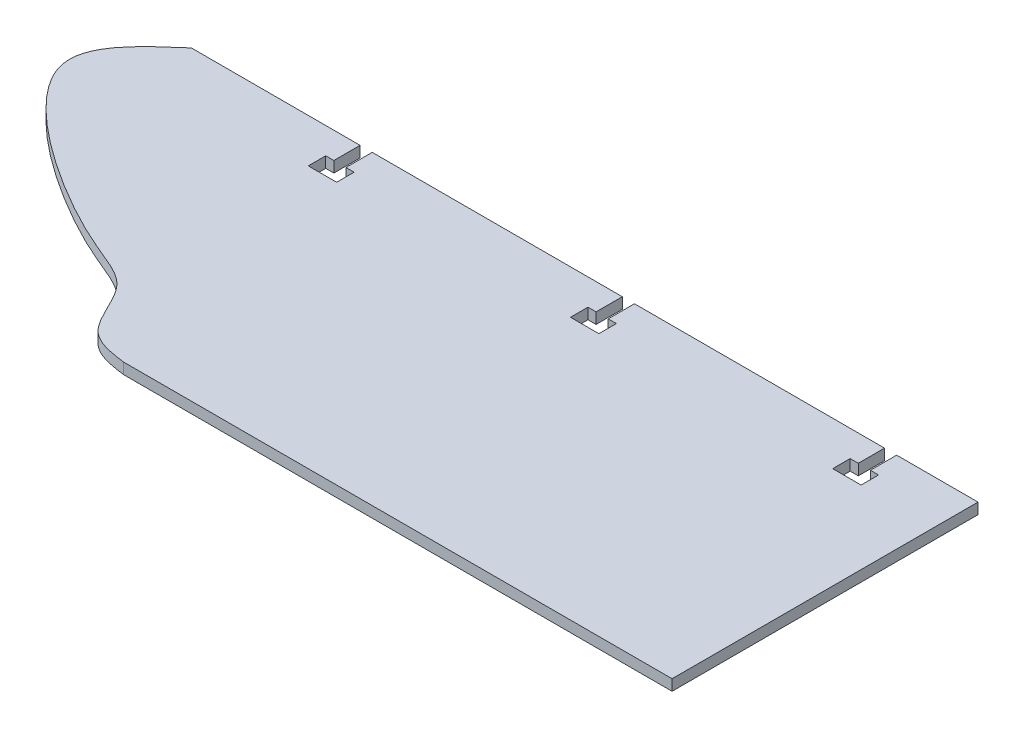
ISO-10303-21;
HEADER;
FILE_DESCRIPTION(('STEP AP214'),'2;1');
FILE_NAME('part.step','',(''),(''),'','','');
FILE_SCHEMA(('AUTOMOTIVE_DESIGN { 1 0 10303 214 1 1 1 1 }'));
ENDSEC;
DATA;
#1=APPLICATION_CONTEXT('core data for automotive mechanical design processes');
#2=APPLICATION_PROTOCOL_DEFINITION('international standard','automotive_design',2000,#1);
#3=PRODUCT_CONTEXT('',#1,'mechanical');
#4=PRODUCT('Part','Part','',(#3));
#5=PRODUCT_RELATED_PRODUCT_CATEGORY('part','',(#4));
#6=PRODUCT_DEFINITION_FORMATION('','',#4);
#7=PRODUCT_DEFINITION_CONTEXT('part definition',#1,'design');
#8=PRODUCT_DEFINITION('design','',#6,#7);
#9=PRODUCT_DEFINITION_SHAPE('','',#8);
#10=(LENGTH_UNIT() NAMED_UNIT(*) SI_UNIT(.MILLI.,.METRE.));
#11=(NAMED_UNIT(*) PLANE_ANGLE_UNIT() SI_UNIT($,.RADIAN.));
#12=(NAMED_UNIT(*) SI_UNIT($,.STERADIAN.) SOLID_ANGLE_UNIT());
#13=UNCERTAINTY_MEASURE_WITH_UNIT(LENGTH_MEASURE(1.E-05),#10,'distance_accuracy_value','');
#14=(GEOMETRIC_REPRESENTATION_CONTEXT(3) GLOBAL_UNCERTAINTY_ASSIGNED_CONTEXT((#13)) GLOBAL_UNIT_ASSIGNED_CONTEXT((#10,
#11,#12)) REPRESENTATION_CONTEXT('',''));
#15=CARTESIAN_POINT('',(0.,0.,0.));
#16=DIRECTION('',(0.,0.,1.));
#17=DIRECTION('',(1.,0.,0.));
#18=AXIS2_PLACEMENT_3D('',#15,#16,#17);
#19=CARTESIAN_POINT('',(-7.32692720957384,-3.175,44.45));
#20=DIRECTION('',(0.,0.,1.));
#21=DIRECTION('',(1.,0.,0.));
#22=AXIS2_PLACEMENT_3D('',#19,#20,#21);
#23=PLANE('',#22);
#24=DIRECTION('',(1.,0.,0.));
#25=VECTOR('',#24,1.);
#26=CARTESIAN_POINT('',(-7.32692720957384,0.,44.45));
#27=LINE('',#26,#25);
#28=CARTESIAN_POINT('',(-45.081302523613,0.,44.45));
#29=VERTEX_POINT('',#28);
#30=CARTESIAN_POINT('',(114.3,0.,44.45));
#31=VERTEX_POINT('',#30);
#32=EDGE_CURVE('E302',#29,#31,#27,.T.);
#33=ORIENTED_EDGE('',*,*,#32,.F.);
#34=DIRECTION('',(0.,1.,0.));
#35=VECTOR('',#34,1.);
#36=CARTESIAN_POINT('',(-45.081302523613,-3.175,44.45));
#37=LINE('',#36,#35);
#38=CARTESIAN_POINT('',(-45.081302523613,-3.175,44.45));
#39=VERTEX_POINT('',#38);
#40=EDGE_CURVE('E10',#39,#29,#37,.T.);
#41=ORIENTED_EDGE('',*,*,#40,.F.);
#42=DIRECTION('',(1.,0.,0.));
#43=VECTOR('',#42,1.);
#44=CARTESIAN_POINT('',(-7.32692720957384,-3.175,44.45));
#45=LINE('',#44,#43);
#46=CARTESIAN_POINT('',(114.3,-3.175,44.45));
#47=VERTEX_POINT('',#46);
#48=EDGE_CURVE('E407',#39,#47,#45,.T.);
#49=ORIENTED_EDGE('',*,*,#48,.T.);
#50=DIRECTION('',(0.,1.,0.));
#51=VECTOR('',#50,1.);
#52=CARTESIAN_POINT('',(114.3,-3.175,44.45));
#53=LINE('',#52,#51);
#54=EDGE_CURVE('E38',#47,#31,#53,.T.);
#55=ORIENTED_EDGE('',*,*,#54,.T.);
#56=EDGE_LOOP('',(#33,#41,#49,#55));
#57=FACE_BOUND('',#56,.T.);
#58=ADVANCED_FACE('F16',(#57),#23,.T.);
#59=CARTESIAN_POINT('',(-114.3,-3.175,-44.45));
#60=CARTESIAN_POINT('',(-122.712622949741,-3.175,-37.1517484903736));
#61=CARTESIAN_POINT('',(-143.440207505629,-3.175,-19.16982701598));
#62=CARTESIAN_POINT('',(-82.8423175853198,-3.175,19.7004032273927));
#63=CARTESIAN_POINT('',(-63.646041049503,-3.175,23.2620201117426));
#64=CARTESIAN_POINT('',(-58.5291170106001,-3.175,42.6152864501039));
#65=CARTESIAN_POINT('',(-49.3668762390292,-3.175,43.865310184985));
#66=CARTESIAN_POINT('',(-45.081302523613,-3.175,44.45));
#67=B_SPLINE_CURVE_WITH_KNOTS('',3,(#59,#60,#61,#62,#63,#64,#65,#66),.UNSPECIFIED.,.F.,.F.,(4,1,
1,1,1,4),(0.,0.210723036526769,0.519193548026157,0.700398339055915,0.859863429127406,1.),.UNSPECIFIED.);
#68=DIRECTION('',(0.,1.,0.));
#69=VECTOR('',#68,1.);
#70=SURFACE_OF_LINEAR_EXTRUSION('',#67,#69);
#71=CARTESIAN_POINT('',(-114.3,0.,-44.45));
#72=CARTESIAN_POINT('',(-122.712622949741,0.,-37.1517484903736));
#73=CARTESIAN_POINT('',(-143.440207505629,0.,-19.16982701598));
#74=CARTESIAN_POINT('',(-82.8423175853198,0.,19.7004032273927));
#75=CARTESIAN_POINT('',(-63.646041049503,0.,23.2620201117426));
#76=CARTESIAN_POINT('',(-58.5291170106001,0.,42.6152864501039));
#77=CARTESIAN_POINT('',(-49.3668762390292,0.,43.865310184985));
#78=CARTESIAN_POINT('',(-45.081302523613,0.,44.45));
#79=B_SPLINE_CURVE_WITH_KNOTS('',3,(#71,#72,#73,#74,#75,#76,#77,#78),.UNSPECIFIED.,.F.,.F.,(4,1,
1,1,1,4),(0.,0.210723036526769,0.519193548026157,0.700398339055915,0.859863429127406,1.),.UNSPECIFIED.);
#80=CARTESIAN_POINT('',(-114.3,0.,-44.45));
#81=VERTEX_POINT('',#80);
#82=EDGE_CURVE('E305',#81,#29,#79,.T.);
#83=ORIENTED_EDGE('',*,*,#82,.F.);
#84=DIRECTION('',(0.,1.,0.));
#85=VECTOR('',#84,1.);
#86=CARTESIAN_POINT('',(-114.3,-3.175,-44.45));
#87=LINE('',#86,#85);
#88=CARTESIAN_POINT('',(-114.3,-3.175,-44.45));
#89=VERTEX_POINT('',#88);
#90=EDGE_CURVE('E25',#89,#81,#87,.T.);
#91=ORIENTED_EDGE('',*,*,#90,.F.);
#92=EDGE_CURVE('E501',#89,#39,#67,.T.);
#93=ORIENTED_EDGE('',*,*,#92,.T.);
#94=ORIENTED_EDGE('',*,*,#40,.T.);
#95=EDGE_LOOP('',(#83,#91,#93,#94));
#96=FACE_BOUND('',#95,.T.);
#97=ADVANCED_FACE('F500',(#96),#70,.T.);
#98=CARTESIAN_POINT('',(-7.32692720957383,-3.175,-44.45));
#99=DIRECTION('',(0.,0.,1.));
#100=DIRECTION('',(1.,0.,0.));
#101=AXIS2_PLACEMENT_3D('',#98,#99,#100);
#102=PLANE('',#101);
#103=DIRECTION('',(1.,0.,0.));
#104=VECTOR('',#103,1.);
#105=CARTESIAN_POINT('',(-7.32692720957383,0.,-44.45));
#106=LINE('',#105,#104);
#107=CARTESIAN_POINT('',(-65.2653,0.,-44.45));
#108=VERTEX_POINT('',#107);
#109=EDGE_CURVE('E311',#81,#108,#106,.T.);
#110=ORIENTED_EDGE('',*,*,#109,.T.);
#111=DIRECTION('',(0.,1.,0.));
#112=VECTOR('',#111,1.);
#113=CARTESIAN_POINT('',(-65.2653,-3.175,-44.45));
#114=LINE('',#113,#112);
#115=CARTESIAN_POINT('',(-65.2653,-3.175,-44.45));
#116=VERTEX_POINT('',#115);
#117=EDGE_CURVE('E482',#116,#108,#114,.T.);
#118=ORIENTED_EDGE('',*,*,#117,.F.);
#119=DIRECTION('',(1.,0.,0.));
#120=VECTOR('',#119,1.);
#121=CARTESIAN_POINT('',(-7.32692720957383,-3.175,-44.45));
#122=LINE('',#121,#120);
#123=EDGE_CURVE('E492',#89,#116,#122,.T.);
#124=ORIENTED_EDGE('',*,*,#123,.F.);
#125=ORIENTED_EDGE('',*,*,#90,.T.);
#126=EDGE_LOOP('',(#110,#118,#124,#125));
#127=FACE_BOUND('',#126,.T.);
#128=ADVANCED_FACE('F490',(#127),#102,.F.);
#129=CARTESIAN_POINT('',(-65.2653,-3.175,-35.3892250344158));
#130=DIRECTION('',(-1.,0.,0.));
#131=DIRECTION('',(0.,0.,1.));
#132=AXIS2_PLACEMENT_3D('',#129,#130,#131);
#133=PLANE('',#132);
#134=DIRECTION('',(0.,0.,1.));
#135=VECTOR('',#134,1.);
#136=CARTESIAN_POINT('',(-65.2653,0.,-35.3892250344158));
#137=LINE('',#136,#135);
#138=CARTESIAN_POINT('',(-65.2653,0.,-36.83));
#139=VERTEX_POINT('',#138);
#140=EDGE_CURVE('E317',#108,#139,#137,.T.);
#141=ORIENTED_EDGE('',*,*,#140,.T.);
#142=DIRECTION('',(0.,1.,0.));
#143=VECTOR('',#142,1.);
#144=CARTESIAN_POINT('',(-65.2653,-3.175,-36.83));
#145=LINE('',#144,#143);
#146=CARTESIAN_POINT('',(-65.2653,-3.175,-36.83));
#147=VERTEX_POINT('',#146);
#148=EDGE_CURVE('E479',#147,#139,#145,.T.);
#149=ORIENTED_EDGE('',*,*,#148,.F.);
#150=DIRECTION('',(0.,0.,1.));
#151=VECTOR('',#150,1.);
#152=CARTESIAN_POINT('',(-65.2653,-3.175,-35.3892250344158));
#153=LINE('',#152,#151);
#154=EDGE_CURVE('E535',#116,#147,#153,.T.);
#155=ORIENTED_EDGE('',*,*,#154,.F.);
#156=ORIENTED_EDGE('',*,*,#117,.T.);
#157=EDGE_LOOP('',(#141,#149,#155,#156));
#158=FACE_BOUND('',#157,.T.);
#159=ADVANCED_FACE('F520',(#158),#133,.F.);
#160=CARTESIAN_POINT('',(-62.5459980219603,-3.175,-36.83));
#161=DIRECTION('',(0.,0.,1.));
#162=DIRECTION('',(1.,0.,0.));
#163=AXIS2_PLACEMENT_3D('',#160,#161,#162);
#164=PLANE('',#163);
#165=DIRECTION('',(1.,0.,0.));
#166=VECTOR('',#165,1.);
#167=CARTESIAN_POINT('',(-62.5459980219603,0.,-36.83));
#168=LINE('',#167,#166);
#169=CARTESIAN_POINT('',(-67.6275,0.,-36.83));
#170=VERTEX_POINT('',#169);
#171=EDGE_CURVE('E321',#170,#139,#168,.T.);
#172=ORIENTED_EDGE('',*,*,#171,.F.);
#173=DIRECTION('',(0.,1.,0.));
#174=VECTOR('',#173,1.);
#175=CARTESIAN_POINT('',(-67.6275,-3.175,-36.83));
#176=LINE('',#175,#174);
#177=CARTESIAN_POINT('',(-67.6275,-3.175,-36.83));
#178=VERTEX_POINT('',#177);
#179=EDGE_CURVE('E476',#178,#170,#176,.T.);
#180=ORIENTED_EDGE('',*,*,#179,.F.);
#181=DIRECTION('',(1.,0.,0.));
#182=VECTOR('',#181,1.);
#183=CARTESIAN_POINT('',(-62.5459980219603,-3.175,-36.83));
#184=LINE('',#183,#182);
#185=EDGE_CURVE('E538',#178,#147,#184,.T.);
#186=ORIENTED_EDGE('',*,*,#185,.T.);
#187=ORIENTED_EDGE('',*,*,#148,.T.);
#188=EDGE_LOOP('',(#172,#180,#186,#187));
#189=FACE_BOUND('',#188,.T.);
#190=ADVANCED_FACE('F695',(#189),#164,.T.);
#191=CARTESIAN_POINT('',(-67.6275,-3.175,-35.2268011206389));
#192=DIRECTION('',(-1.,0.,0.));
#193=DIRECTION('',(0.,0.,1.));
#194=AXIS2_PLACEMENT_3D('',#191,#192,#193);
#195=PLANE('',#194);
#196=DIRECTION('',(0.,0.,1.));
#197=VECTOR('',#196,1.);
#198=CARTESIAN_POINT('',(-67.6275,0.,-35.2268011206389));
#199=LINE('',#198,#197);
#200=CARTESIAN_POINT('',(-67.6275,0.,-31.75));
#201=VERTEX_POINT('',#200);
#202=EDGE_CURVE('E325',#170,#201,#199,.T.);
#203=ORIENTED_EDGE('',*,*,#202,.T.);
#204=DIRECTION('',(0.,1.,0.));
#205=VECTOR('',#204,1.);
#206=CARTESIAN_POINT('',(-67.6275,-3.175,-31.75));
#207=LINE('',#206,#205);
#208=CARTESIAN_POINT('',(-67.6275,-3.175,-31.75));
#209=VERTEX_POINT('',#208);
#210=EDGE_CURVE('E472',#209,#201,#207,.T.);
#211=ORIENTED_EDGE('',*,*,#210,.F.);
#212=DIRECTION('',(0.,0.,1.));
#213=VECTOR('',#212,1.);
#214=CARTESIAN_POINT('',(-67.6275,-3.175,-35.2268011206389));
#215=LINE('',#214,#213);
#216=EDGE_CURVE('E542',#178,#209,#215,.T.);
#217=ORIENTED_EDGE('',*,*,#216,.F.);
#218=ORIENTED_EDGE('',*,*,#179,.T.);
#219=EDGE_LOOP('',(#203,#211,#217,#218));
#220=FACE_BOUND('',#219,.T.);
#221=ADVANCED_FACE('F691',(#220),#195,.F.);
#222=CARTESIAN_POINT('',(-62.5459980219603,-3.175,-31.75));
#223=DIRECTION('',(0.,0.,1.));
#224=DIRECTION('',(1.,0.,0.));
#225=AXIS2_PLACEMENT_3D('',#222,#223,#224);
#226=PLANE('',#225);
#227=DIRECTION('',(1.,0.,0.));
#228=VECTOR('',#227,1.);
#229=CARTESIAN_POINT('',(-62.5459980219603,0.,-31.75));
#230=LINE('',#229,#228);
#231=CARTESIAN_POINT('',(-59.3725,0.,-31.75));
#232=VERTEX_POINT('',#231);
#233=EDGE_CURVE('E328',#201,#232,#230,.T.);
#234=ORIENTED_EDGE('',*,*,#233,.T.);
#235=DIRECTION('',(0.,1.,0.));
#236=VECTOR('',#235,1.);
#237=CARTESIAN_POINT('',(-59.3725,-3.175,-31.75));
#238=LINE('',#237,#236);
#239=CARTESIAN_POINT('',(-59.3725,-3.175,-31.75));
#240=VERTEX_POINT('',#239);
#241=EDGE_CURVE('E469',#240,#232,#238,.T.);
#242=ORIENTED_EDGE('',*,*,#241,.F.);
#243=DIRECTION('',(1.,0.,0.));
#244=VECTOR('',#243,1.);
#245=CARTESIAN_POINT('',(-62.5459980219603,-3.175,-31.75));
#246=LINE('',#245,#244);
#247=EDGE_CURVE('E545',#209,#240,#246,.T.);
#248=ORIENTED_EDGE('',*,*,#247,.F.);
#249=ORIENTED_EDGE('',*,*,#210,.T.);
#250=EDGE_LOOP('',(#234,#242,#248,#249));
#251=FACE_BOUND('',#250,.T.);
#252=ADVANCED_FACE('F687',(#251),#226,.F.);
#253=CARTESIAN_POINT('',(-59.3725,-3.175,-35.2268011206389));
#254=DIRECTION('',(-1.,0.,0.));
#255=DIRECTION('',(0.,0.,1.));
#256=AXIS2_PLACEMENT_3D('',#253,#254,#255);
#257=PLANE('',#256);
#258=DIRECTION('',(0.,0.,1.));
#259=VECTOR('',#258,1.);
#260=CARTESIAN_POINT('',(-59.3725,0.,-35.2268011206389));
#261=LINE('',#260,#259);
#262=CARTESIAN_POINT('',(-59.3725,0.,-36.83));
#263=VERTEX_POINT('',#262);
#264=EDGE_CURVE('E332',#263,#232,#261,.T.);
#265=ORIENTED_EDGE('',*,*,#264,.F.);
#266=DIRECTION('',(0.,1.,0.));
#267=VECTOR('',#266,1.);
#268=CARTESIAN_POINT('',(-59.3725,-3.175,-36.83));
#269=LINE('',#268,#267);
#270=CARTESIAN_POINT('',(-59.3725,-3.175,-36.83));
#271=VERTEX_POINT('',#270);
#272=EDGE_CURVE('E466',#271,#263,#269,.T.);
#273=ORIENTED_EDGE('',*,*,#272,.F.);
#274=DIRECTION('',(0.,0.,1.));
#275=VECTOR('',#274,1.);
#276=CARTESIAN_POINT('',(-59.3725,-3.175,-35.2268011206389));
#277=LINE('',#276,#275);
#278=EDGE_CURVE('E548',#271,#240,#277,.T.);
#279=ORIENTED_EDGE('',*,*,#278,.T.);
#280=ORIENTED_EDGE('',*,*,#241,.T.);
#281=EDGE_LOOP('',(#265,#273,#279,#280));
#282=FACE_BOUND('',#281,.T.);
#283=ADVANCED_FACE('F682',(#282),#257,.T.);
#284=CARTESIAN_POINT('',(-60.5536,-3.175,-36.83));
#285=DIRECTION('',(0.,0.,1.));
#286=DIRECTION('',(1.,0.,0.));
#287=AXIS2_PLACEMENT_3D('',#284,#285,#286);
#288=PLANE('',#287);
#289=DIRECTION('',(1.,0.,0.));
#290=VECTOR('',#289,1.);
#291=CARTESIAN_POINT('',(-60.5536,0.,-36.83));
#292=LINE('',#291,#290);
#293=CARTESIAN_POINT('',(-61.7347,0.,-36.83));
#294=VERTEX_POINT('',#293);
#295=EDGE_CURVE('E336',#294,#263,#292,.T.);
#296=ORIENTED_EDGE('',*,*,#295,.F.);
#297=DIRECTION('',(0.,1.,0.));
#298=VECTOR('',#297,1.);
#299=CARTESIAN_POINT('',(-61.7347,-3.175,-36.83));
#300=LINE('',#299,#298);
#301=CARTESIAN_POINT('',(-61.7347,-3.175,-36.83));
#302=VERTEX_POINT('',#301);
#303=EDGE_CURVE('E463',#302,#294,#300,.T.);
#304=ORIENTED_EDGE('',*,*,#303,.F.);
#305=DIRECTION('',(1.,0.,0.));
#306=VECTOR('',#305,1.);
#307=CARTESIAN_POINT('',(-60.5536,-3.175,-36.83));
#308=LINE('',#307,#306);
#309=EDGE_CURVE('E552',#302,#271,#308,.T.);
#310=ORIENTED_EDGE('',*,*,#309,.T.);
#311=ORIENTED_EDGE('',*,*,#272,.T.);
#312=EDGE_LOOP('',(#296,#304,#310,#311));
#313=FACE_BOUND('',#312,.T.);
#314=ADVANCED_FACE('F677',(#313),#288,.T.);
#315=CARTESIAN_POINT('',(-61.7347,-3.175,-35.3892250344158));
#316=DIRECTION('',(-1.,0.,0.));
#317=DIRECTION('',(0.,0.,1.));
#318=AXIS2_PLACEMENT_3D('',#315,#316,#317);
#319=PLANE('',#318);
#320=DIRECTION('',(0.,0.,1.));
#321=VECTOR('',#320,1.);
#322=CARTESIAN_POINT('',(-61.7347,0.,-35.3892250344158));
#323=LINE('',#322,#321);
#324=CARTESIAN_POINT('',(-61.7347,0.,-44.45));
#325=VERTEX_POINT('',#324);
#326=EDGE_CURVE('E340',#325,#294,#323,.T.);
#327=ORIENTED_EDGE('',*,*,#326,.F.);
#328=DIRECTION('',(0.,1.,0.));
#329=VECTOR('',#328,1.);
#330=CARTESIAN_POINT('',(-61.7347,-3.175,-44.45));
#331=LINE('',#330,#329);
#332=CARTESIAN_POINT('',(-61.7347,-3.175,-44.45));
#333=VERTEX_POINT('',#332);
#334=EDGE_CURVE('E460',#333,#325,#331,.T.);
#335=ORIENTED_EDGE('',*,*,#334,.F.);
#336=DIRECTION('',(0.,0.,1.));
#337=VECTOR('',#336,1.);
#338=CARTESIAN_POINT('',(-61.7347,-3.175,-35.3892250344158));
#339=LINE('',#338,#337);
#340=EDGE_CURVE('E556',#333,#302,#339,.T.);
#341=ORIENTED_EDGE('',*,*,#340,.T.);
#342=ORIENTED_EDGE('',*,*,#303,.T.);
#343=EDGE_LOOP('',(#327,#335,#341,#342));
#344=FACE_BOUND('',#343,.T.);
#345=ADVANCED_FACE('F671',(#344),#319,.T.);
#346=CARTESIAN_POINT('',(26.28265,-3.175,-44.45));
#347=DIRECTION('',(0.,0.,1.));
#348=DIRECTION('',(1.,0.,0.));
#349=AXIS2_PLACEMENT_3D('',#346,#347,#348);
#350=PLANE('',#349);
#351=DIRECTION('',(1.,0.,0.));
#352=VECTOR('',#351,1.);
#353=CARTESIAN_POINT('',(26.28265,0.,-44.45));
#354=LINE('',#353,#352);
#355=CARTESIAN_POINT('',(10.9347,0.,-44.45));
#356=VERTEX_POINT('',#355);
#357=EDGE_CURVE('E344',#325,#356,#354,.T.);
#358=ORIENTED_EDGE('',*,*,#357,.T.);
#359=DIRECTION('',(0.,1.,0.));
#360=VECTOR('',#359,1.);
#361=CARTESIAN_POINT('',(10.9347,-3.175,-44.45));
#362=LINE('',#361,#360);
#363=CARTESIAN_POINT('',(10.9347,-3.175,-44.45));
#364=VERTEX_POINT('',#363);
#365=EDGE_CURVE('E456',#364,#356,#362,.T.);
#366=ORIENTED_EDGE('',*,*,#365,.F.);
#367=DIRECTION('',(1.,0.,0.));
#368=VECTOR('',#367,1.);
#369=CARTESIAN_POINT('',(26.28265,-3.175,-44.45));
#370=LINE('',#369,#368);
#371=EDGE_CURVE('E560',#333,#364,#370,.T.);
#372=ORIENTED_EDGE('',*,*,#371,.F.);
#373=ORIENTED_EDGE('',*,*,#334,.T.);
#374=EDGE_LOOP('',(#358,#366,#372,#373));
#375=FACE_BOUND('',#374,.T.);
#376=ADVANCED_FACE('F768',(#375),#350,.F.);
#377=CARTESIAN_POINT('',(10.9347,-3.175,-35.3892250344158));
#378=DIRECTION('',(-1.,0.,0.));
#379=DIRECTION('',(0.,0.,1.));
#380=AXIS2_PLACEMENT_3D('',#377,#378,#379);
#381=PLANE('',#380);
#382=DIRECTION('',(0.,0.,1.));
#383=VECTOR('',#382,1.);
#384=CARTESIAN_POINT('',(10.9347,0.,-35.3892250344158));
#385=LINE('',#384,#383);
#386=CARTESIAN_POINT('',(10.9347,0.,-36.83));
#387=VERTEX_POINT('',#386);
#388=EDGE_CURVE('E347',#356,#387,#385,.T.);
#389=ORIENTED_EDGE('',*,*,#388,.T.);
#390=DIRECTION('',(0.,1.,0.));
#391=VECTOR('',#390,1.);
#392=CARTESIAN_POINT('',(10.9347,-3.175,-36.83));
#393=LINE('',#392,#391);
#394=CARTESIAN_POINT('',(10.9347,-3.175,-36.83));
#395=VERTEX_POINT('',#394);
#396=EDGE_CURVE('E453',#395,#387,#393,.T.);
#397=ORIENTED_EDGE('',*,*,#396,.F.);
#398=DIRECTION('',(0.,0.,1.));
#399=VECTOR('',#398,1.);
#400=CARTESIAN_POINT('',(10.9347,-3.175,-35.3892250344158));
#401=LINE('',#400,#399);
#402=EDGE_CURVE('E563',#364,#395,#401,.T.);
#403=ORIENTED_EDGE('',*,*,#402,.F.);
#404=ORIENTED_EDGE('',*,*,#365,.T.);
#405=EDGE_LOOP('',(#389,#397,#403,#404));
#406=FACE_BOUND('',#405,.T.);
#407=ADVANCED_FACE('F665',(#406),#381,.F.);
#408=CARTESIAN_POINT('',(13.6540019780397,-3.175,-36.83));
#409=DIRECTION('',(0.,0.,1.));
#410=DIRECTION('',(1.,0.,0.));
#411=AXIS2_PLACEMENT_3D('',#408,#409,#410);
#412=PLANE('',#411);
#413=DIRECTION('',(1.,0.,0.));
#414=VECTOR('',#413,1.);
#415=CARTESIAN_POINT('',(13.6540019780397,0.,-36.83));
#416=LINE('',#415,#414);
#417=CARTESIAN_POINT('',(8.5725,0.,-36.83));
#418=VERTEX_POINT('',#417);
#419=EDGE_CURVE('E351',#418,#387,#416,.T.);
#420=ORIENTED_EDGE('',*,*,#419,.F.);
#421=DIRECTION('',(0.,1.,0.));
#422=VECTOR('',#421,1.);
#423=CARTESIAN_POINT('',(8.5725,-3.175,-36.83));
#424=LINE('',#423,#422);
#425=CARTESIAN_POINT('',(8.5725,-3.175,-36.83));
#426=VERTEX_POINT('',#425);
#427=EDGE_CURVE('E450',#426,#418,#424,.T.);
#428=ORIENTED_EDGE('',*,*,#427,.F.);
#429=DIRECTION('',(1.,0.,0.));
#430=VECTOR('',#429,1.);
#431=CARTESIAN_POINT('',(13.6540019780397,-3.175,-36.83));
#432=LINE('',#431,#430);
#433=EDGE_CURVE('E566',#426,#395,#432,.T.);
#434=ORIENTED_EDGE('',*,*,#433,.T.);
#435=ORIENTED_EDGE('',*,*,#396,.T.);
#436=EDGE_LOOP('',(#420,#428,#434,#435));
#437=FACE_BOUND('',#436,.T.);
#438=ADVANCED_FACE('F659',(#437),#412,.T.);
#439=CARTESIAN_POINT('',(8.5725,-3.175,-35.2268011206389));
#440=DIRECTION('',(-1.,0.,0.));
#441=DIRECTION('',(0.,0.,1.));
#442=AXIS2_PLACEMENT_3D('',#439,#440,#441);
#443=PLANE('',#442);
#444=DIRECTION('',(0.,0.,1.));
#445=VECTOR('',#444,1.);
#446=CARTESIAN_POINT('',(8.5725,0.,-35.2268011206389));
#447=LINE('',#446,#445);
#448=CARTESIAN_POINT('',(8.5725,0.,-31.75));
#449=VERTEX_POINT('',#448);
#450=EDGE_CURVE('E355',#418,#449,#447,.T.);
#451=ORIENTED_EDGE('',*,*,#450,.T.);
#452=DIRECTION('',(0.,1.,0.));
#453=VECTOR('',#452,1.);
#454=CARTESIAN_POINT('',(8.5725,-3.175,-31.75));
#455=LINE('',#454,#453);
#456=CARTESIAN_POINT('',(8.5725,-3.175,-31.75));
#457=VERTEX_POINT('',#456);
#458=EDGE_CURVE('E446',#457,#449,#455,.T.);
#459=ORIENTED_EDGE('',*,*,#458,.F.);
#460=DIRECTION('',(0.,0.,1.));
#461=VECTOR('',#460,1.);
#462=CARTESIAN_POINT('',(8.5725,-3.175,-35.2268011206389));
#463=LINE('',#462,#461);
#464=EDGE_CURVE('E570',#426,#457,#463,.T.);
#465=ORIENTED_EDGE('',*,*,#464,.F.);
#466=ORIENTED_EDGE('',*,*,#427,.T.);
#467=EDGE_LOOP('',(#451,#459,#465,#466));
#468=FACE_BOUND('',#467,.T.);
#469=ADVANCED_FACE('F815',(#468),#443,.F.);
#470=CARTESIAN_POINT('',(13.6540019780397,-3.175,-31.75));
#471=DIRECTION('',(0.,0.,1.));
#472=DIRECTION('',(1.,0.,0.));
#473=AXIS2_PLACEMENT_3D('',#470,#471,#472);
#474=PLANE('',#473);
#475=DIRECTION('',(1.,0.,0.));
#476=VECTOR('',#475,1.);
#477=CARTESIAN_POINT('',(13.6540019780397,0.,-31.75));
#478=LINE('',#477,#476);
#479=CARTESIAN_POINT('',(16.8275,0.,-31.75));
#480=VERTEX_POINT('',#479);
#481=EDGE_CURVE('E358',#449,#480,#478,.T.);
#482=ORIENTED_EDGE('',*,*,#481,.T.);
#483=DIRECTION('',(0.,1.,0.));
#484=VECTOR('',#483,1.);
#485=CARTESIAN_POINT('',(16.8275,-3.175,-31.75));
#486=LINE('',#485,#484);
#487=CARTESIAN_POINT('',(16.8275,-3.175,-31.75));
#488=VERTEX_POINT('',#487);
#489=EDGE_CURVE('E443',#488,#480,#486,.T.);
#490=ORIENTED_EDGE('',*,*,#489,.F.);
#491=DIRECTION('',(1.,0.,0.));
#492=VECTOR('',#491,1.);
#493=CARTESIAN_POINT('',(13.6540019780397,-3.175,-31.75));
#494=LINE('',#493,#492);
#495=EDGE_CURVE('E573',#457,#488,#494,.T.);
#496=ORIENTED_EDGE('',*,*,#495,.F.);
#497=ORIENTED_EDGE('',*,*,#458,.T.);
#498=EDGE_LOOP('',(#482,#490,#496,#497));
#499=FACE_BOUND('',#498,.T.);
#500=ADVANCED_FACE('F652',(#499),#474,.F.);
#501=CARTESIAN_POINT('',(16.8275,-3.175,-35.2268011206389));
#502=DIRECTION('',(-1.,0.,0.));
#503=DIRECTION('',(0.,0.,1.));
#504=AXIS2_PLACEMENT_3D('',#501,#502,#503);
#505=PLANE('',#504);
#506=DIRECTION('',(0.,0.,1.));
#507=VECTOR('',#506,1.);
#508=CARTESIAN_POINT('',(16.8275,0.,-35.2268011206389));
#509=LINE('',#508,#507);
#510=CARTESIAN_POINT('',(16.8275,0.,-36.83));
#511=VERTEX_POINT('',#510);
#512=EDGE_CURVE('E362',#511,#480,#509,.T.);
#513=ORIENTED_EDGE('',*,*,#512,.F.);
#514=DIRECTION('',(0.,1.,0.));
#515=VECTOR('',#514,1.);
#516=CARTESIAN_POINT('',(16.8275,-3.175,-36.83));
#517=LINE('',#516,#515);
#518=CARTESIAN_POINT('',(16.8275,-3.175,-36.83));
#519=VERTEX_POINT('',#518);
#520=EDGE_CURVE('E440',#519,#511,#517,.T.);
#521=ORIENTED_EDGE('',*,*,#520,.F.);
#522=DIRECTION('',(0.,0.,1.));
#523=VECTOR('',#522,1.);
#524=CARTESIAN_POINT('',(16.8275,-3.175,-35.2268011206389));
#525=LINE('',#524,#523);
#526=EDGE_CURVE('E576',#519,#488,#525,.T.);
#527=ORIENTED_EDGE('',*,*,#526,.T.);
#528=ORIENTED_EDGE('',*,*,#489,.T.);
#529=EDGE_LOOP('',(#513,#521,#527,#528));
#530=FACE_BOUND('',#529,.T.);
#531=ADVANCED_FACE('F648',(#530),#505,.T.);
#532=CARTESIAN_POINT('',(15.6464,-3.175,-36.83));
#533=DIRECTION('',(0.,0.,1.));
#534=DIRECTION('',(1.,0.,0.));
#535=AXIS2_PLACEMENT_3D('',#532,#533,#534);
#536=PLANE('',#535);
#537=DIRECTION('',(1.,0.,0.));
#538=VECTOR('',#537,1.);
#539=CARTESIAN_POINT('',(15.6464,0.,-36.83));
#540=LINE('',#539,#538);
#541=CARTESIAN_POINT('',(14.4653,0.,-36.83));
#542=VERTEX_POINT('',#541);
#543=EDGE_CURVE('E366',#542,#511,#540,.T.);
#544=ORIENTED_EDGE('',*,*,#543,.F.);
#545=DIRECTION('',(0.,1.,0.));
#546=VECTOR('',#545,1.);
#547=CARTESIAN_POINT('',(14.4653,-3.175,-36.83));
#548=LINE('',#547,#546);
#549=CARTESIAN_POINT('',(14.4653,-3.175,-36.83));
#550=VERTEX_POINT('',#549);
#551=EDGE_CURVE('E437',#550,#542,#548,.T.);
#552=ORIENTED_EDGE('',*,*,#551,.F.);
#553=DIRECTION('',(1.,0.,0.));
#554=VECTOR('',#553,1.);
#555=CARTESIAN_POINT('',(15.6464,-3.175,-36.83));
#556=LINE('',#555,#554);
#557=EDGE_CURVE('E580',#550,#519,#556,.T.);
#558=ORIENTED_EDGE('',*,*,#557,.T.);
#559=ORIENTED_EDGE('',*,*,#520,.T.);
#560=EDGE_LOOP('',(#544,#552,#558,#559));
#561=FACE_BOUND('',#560,.T.);
#562=ADVANCED_FACE('F644',(#561),#536,.T.);
#563=CARTESIAN_POINT('',(14.4653,-3.175,-35.3892250344158));
#564=DIRECTION('',(-1.,0.,0.));
#565=DIRECTION('',(0.,0.,1.));
#566=AXIS2_PLACEMENT_3D('',#563,#564,#565);
#567=PLANE('',#566);
#568=DIRECTION('',(0.,0.,1.));
#569=VECTOR('',#568,1.);
#570=CARTESIAN_POINT('',(14.4653,0.,-35.3892250344158));
#571=LINE('',#570,#569);
#572=CARTESIAN_POINT('',(14.4653,0.,-44.45));
#573=VERTEX_POINT('',#572);
#574=EDGE_CURVE('E370',#573,#542,#571,.T.);
#575=ORIENTED_EDGE('',*,*,#574,.F.);
#576=DIRECTION('',(0.,1.,0.));
#577=VECTOR('',#576,1.);
#578=CARTESIAN_POINT('',(14.4653,-3.175,-44.45));
#579=LINE('',#578,#577);
#580=CARTESIAN_POINT('',(14.4653,-3.175,-44.45));
#581=VERTEX_POINT('',#580);
#582=EDGE_CURVE('E434',#581,#573,#579,.T.);
#583=ORIENTED_EDGE('',*,*,#582,.F.);
#584=DIRECTION('',(0.,0.,1.));
#585=VECTOR('',#584,1.);
#586=CARTESIAN_POINT('',(14.4653,-3.175,-35.3892250344158));
#587=LINE('',#586,#585);
#588=EDGE_CURVE('E584',#581,#550,#587,.T.);
#589=ORIENTED_EDGE('',*,*,#588,.T.);
#590=ORIENTED_EDGE('',*,*,#551,.T.);
#591=EDGE_LOOP('',(#575,#583,#589,#590));
#592=FACE_BOUND('',#591,.T.);
#593=ADVANCED_FACE('F639',(#592),#567,.T.);
#594=CARTESIAN_POINT('',(64.38265,-3.175,-44.45));
#595=DIRECTION('',(0.,0.,1.));
#596=DIRECTION('',(1.,0.,0.));
#597=AXIS2_PLACEMENT_3D('',#594,#595,#596);
#598=PLANE('',#597);
#599=DIRECTION('',(1.,0.,0.));
#600=VECTOR('',#599,1.);
#601=CARTESIAN_POINT('',(64.38265,0.,-44.45));
#602=LINE('',#601,#600);
#603=CARTESIAN_POINT('',(87.1347,0.,-44.45));
#604=VERTEX_POINT('',#603);
#605=EDGE_CURVE('E374',#573,#604,#602,.T.);
#606=ORIENTED_EDGE('',*,*,#605,.T.);
#607=DIRECTION('',(0.,1.,0.));
#608=VECTOR('',#607,1.);
#609=CARTESIAN_POINT('',(87.1347,-3.175,-44.45));
#610=LINE('',#609,#608);
#611=CARTESIAN_POINT('',(87.1347,-3.175,-44.45));
#612=VERTEX_POINT('',#611);
#613=EDGE_CURVE('E430',#612,#604,#610,.T.);
#614=ORIENTED_EDGE('',*,*,#613,.F.);
#615=DIRECTION('',(1.,0.,0.));
#616=VECTOR('',#615,1.);
#617=CARTESIAN_POINT('',(64.38265,-3.175,-44.45));
#618=LINE('',#617,#616);
#619=EDGE_CURVE('E588',#581,#612,#618,.T.);
#620=ORIENTED_EDGE('',*,*,#619,.F.);
#621=ORIENTED_EDGE('',*,*,#582,.T.);
#622=EDGE_LOOP('',(#606,#614,#620,#621));
#623=FACE_BOUND('',#622,.T.);
#624=ADVANCED_FACE('F636',(#623),#598,.F.);
#625=CARTESIAN_POINT('',(87.1347,-3.175,-35.3892250344158));
#626=DIRECTION('',(-1.,0.,0.));
#627=DIRECTION('',(0.,0.,1.));
#628=AXIS2_PLACEMENT_3D('',#625,#626,#627);
#629=PLANE('',#628);
#630=DIRECTION('',(0.,0.,1.));
#631=VECTOR('',#630,1.);
#632=CARTESIAN_POINT('',(87.1347,0.,-35.3892250344158));
#633=LINE('',#632,#631);
#634=CARTESIAN_POINT('',(87.1347,0.,-36.83));
#635=VERTEX_POINT('',#634);
#636=EDGE_CURVE('E376',#604,#635,#633,.T.);
#637=ORIENTED_EDGE('',*,*,#636,.T.);
#638=DIRECTION('',(0.,1.,0.));
#639=VECTOR('',#638,1.);
#640=CARTESIAN_POINT('',(87.1347,-3.175,-36.83));
#641=LINE('',#640,#639);
#642=CARTESIAN_POINT('',(87.1347,-3.175,-36.83));
#643=VERTEX_POINT('',#642);
#644=EDGE_CURVE('E427',#643,#635,#641,.T.);
#645=ORIENTED_EDGE('',*,*,#644,.F.);
#646=DIRECTION('',(0.,0.,1.));
#647=VECTOR('',#646,1.);
#648=CARTESIAN_POINT('',(87.1347,-3.175,-35.3892250344158));
#649=LINE('',#648,#647);
#650=EDGE_CURVE('E591',#612,#643,#649,.T.);
#651=ORIENTED_EDGE('',*,*,#650,.F.);
#652=ORIENTED_EDGE('',*,*,#613,.T.);
#653=EDGE_LOOP('',(#637,#645,#651,#652));
#654=FACE_BOUND('',#653,.T.);
#655=ADVANCED_FACE('F631',(#654),#629,.F.);
#656=CARTESIAN_POINT('',(89.8540019780398,-3.175,-36.83));
#657=DIRECTION('',(0.,0.,1.));
#658=DIRECTION('',(1.,0.,0.));
#659=AXIS2_PLACEMENT_3D('',#656,#657,#658);
#660=PLANE('',#659);
#661=DIRECTION('',(1.,0.,0.));
#662=VECTOR('',#661,1.);
#663=CARTESIAN_POINT('',(89.8540019780398,0.,-36.83));
#664=LINE('',#663,#662);
#665=CARTESIAN_POINT('',(84.7725,0.,-36.83));
#666=VERTEX_POINT('',#665);
#667=EDGE_CURVE('E380',#666,#635,#664,.T.);
#668=ORIENTED_EDGE('',*,*,#667,.F.);
#669=DIRECTION('',(0.,1.,0.));
#670=VECTOR('',#669,1.);
#671=CARTESIAN_POINT('',(84.7725,-3.175,-36.83));
#672=LINE('',#671,#670);
#673=CARTESIAN_POINT('',(84.7725,-3.175,-36.83));
#674=VERTEX_POINT('',#673);
#675=EDGE_CURVE('E424',#674,#666,#672,.T.);
#676=ORIENTED_EDGE('',*,*,#675,.F.);
#677=DIRECTION('',(1.,0.,0.));
#678=VECTOR('',#677,1.);
#679=CARTESIAN_POINT('',(89.8540019780398,-3.175,-36.83));
#680=LINE('',#679,#678);
#681=EDGE_CURVE('E594',#674,#643,#680,.T.);
#682=ORIENTED_EDGE('',*,*,#681,.T.);
#683=ORIENTED_EDGE('',*,*,#644,.T.);
#684=EDGE_LOOP('',(#668,#676,#682,#683));
#685=FACE_BOUND('',#684,.T.);
#686=ADVANCED_FACE('F625',(#685),#660,.T.);
#687=CARTESIAN_POINT('',(84.7725,-3.175,-35.2268011206389));
#688=DIRECTION('',(-1.,0.,0.));
#689=DIRECTION('',(0.,0.,1.));
#690=AXIS2_PLACEMENT_3D('',#687,#688,#689);
#691=PLANE('',#690);
#692=DIRECTION('',(0.,0.,1.));
#693=VECTOR('',#692,1.);
#694=CARTESIAN_POINT('',(84.7725,0.,-35.2268011206389));
#695=LINE('',#694,#693);
#696=CARTESIAN_POINT('',(84.7725,0.,-31.75));
#697=VERTEX_POINT('',#696);
#698=EDGE_CURVE('E384',#666,#697,#695,.T.);
#699=ORIENTED_EDGE('',*,*,#698,.T.);
#700=DIRECTION('',(0.,1.,0.));
#701=VECTOR('',#700,1.);
#702=CARTESIAN_POINT('',(84.7725,-3.175,-31.75));
#703=LINE('',#702,#701);
#704=CARTESIAN_POINT('',(84.7725,-3.175,-31.75));
#705=VERTEX_POINT('',#704);
#706=EDGE_CURVE('E420',#705,#697,#703,.T.);
#707=ORIENTED_EDGE('',*,*,#706,.F.);
#708=DIRECTION('',(0.,0.,1.));
#709=VECTOR('',#708,1.);
#710=CARTESIAN_POINT('',(84.7725,-3.175,-35.2268011206389));
#711=LINE('',#710,#709);
#712=EDGE_CURVE('E598',#674,#705,#711,.T.);
#713=ORIENTED_EDGE('',*,*,#712,.F.);
#714=ORIENTED_EDGE('',*,*,#675,.T.);
#715=EDGE_LOOP('',(#699,#707,#713,#714));
#716=FACE_BOUND('',#715,.T.);
#717=ADVANCED_FACE('F622',(#716),#691,.F.);
#718=CARTESIAN_POINT('',(89.8540019780398,-3.175,-31.75));
#719=DIRECTION('',(0.,0.,1.));
#720=DIRECTION('',(1.,0.,0.));
#721=AXIS2_PLACEMENT_3D('',#718,#719,#720);
#722=PLANE('',#721);
#723=DIRECTION('',(1.,0.,0.));
#724=VECTOR('',#723,1.);
#725=CARTESIAN_POINT('',(89.8540019780398,0.,-31.75));
#726=LINE('',#725,#724);
#727=CARTESIAN_POINT('',(93.0275,0.,-31.75));
#728=VERTEX_POINT('',#727);
#729=EDGE_CURVE('E387',#697,#728,#726,.T.);
#730=ORIENTED_EDGE('',*,*,#729,.T.);
#731=DIRECTION('',(0.,1.,0.));
#732=VECTOR('',#731,1.);
#733=CARTESIAN_POINT('',(93.0275,-3.175,-31.75));
#734=LINE('',#733,#732);
#735=CARTESIAN_POINT('',(93.0275,-3.175,-31.75));
#736=VERTEX_POINT('',#735);
#737=EDGE_CURVE('E417',#736,#728,#734,.T.);
#738=ORIENTED_EDGE('',*,*,#737,.F.);
#739=DIRECTION('',(1.,0.,0.));
#740=VECTOR('',#739,1.);
#741=CARTESIAN_POINT('',(89.8540019780398,-3.175,-31.75));
#742=LINE('',#741,#740);
#743=EDGE_CURVE('E601',#705,#736,#742,.T.);
#744=ORIENTED_EDGE('',*,*,#743,.F.);
#745=ORIENTED_EDGE('',*,*,#706,.T.);
#746=EDGE_LOOP('',(#730,#738,#744,#745));
#747=FACE_BOUND('',#746,.T.);
#748=ADVANCED_FACE('F618',(#747),#722,.F.);
#749=CARTESIAN_POINT('',(93.0275,-3.175,-35.2268011206389));
#750=DIRECTION('',(-1.,0.,0.));
#751=DIRECTION('',(0.,0.,1.));
#752=AXIS2_PLACEMENT_3D('',#749,#750,#751);
#753=PLANE('',#752);
#754=DIRECTION('',(0.,0.,1.));
#755=VECTOR('',#754,1.);
#756=CARTESIAN_POINT('',(93.0275,0.,-35.2268011206389));
#757=LINE('',#756,#755);
#758=CARTESIAN_POINT('',(93.0275,0.,-36.83));
#759=VERTEX_POINT('',#758);
#760=EDGE_CURVE('E391',#759,#728,#757,.T.);
#761=ORIENTED_EDGE('',*,*,#760,.F.);
#762=DIRECTION('',(0.,1.,0.));
#763=VECTOR('',#762,1.);
#764=CARTESIAN_POINT('',(93.0275,-3.175,-36.83));
#765=LINE('',#764,#763);
#766=CARTESIAN_POINT('',(93.0275,-3.175,-36.83));
#767=VERTEX_POINT('',#766);
#768=EDGE_CURVE('E414',#767,#759,#765,.T.);
#769=ORIENTED_EDGE('',*,*,#768,.F.);
#770=DIRECTION('',(0.,0.,1.));
#771=VECTOR('',#770,1.);
#772=CARTESIAN_POINT('',(93.0275,-3.175,-35.2268011206389));
#773=LINE('',#772,#771);
#774=EDGE_CURVE('E296',#767,#736,#773,.T.);
#775=ORIENTED_EDGE('',*,*,#774,.T.);
#776=ORIENTED_EDGE('',*,*,#737,.T.);
#777=EDGE_LOOP('',(#761,#769,#775,#776));
#778=FACE_BOUND('',#777,.T.);
#779=ADVANCED_FACE('F608',(#778),#753,.T.);
#780=CARTESIAN_POINT('',(91.8464,-3.175,-36.83));
#781=DIRECTION('',(0.,0.,1.));
#782=DIRECTION('',(1.,0.,0.));
#783=AXIS2_PLACEMENT_3D('',#780,#781,#782);
#784=PLANE('',#783);
#785=DIRECTION('',(1.,0.,0.));
#786=VECTOR('',#785,1.);
#787=CARTESIAN_POINT('',(91.8464,0.,-36.83));
#788=LINE('',#787,#786);
#789=CARTESIAN_POINT('',(90.6653,0.,-36.83));
#790=VERTEX_POINT('',#789);
#791=EDGE_CURVE('E395',#790,#759,#788,.T.);
#792=ORIENTED_EDGE('',*,*,#791,.F.);
#793=DIRECTION('',(0.,1.,0.));
#794=VECTOR('',#793,1.);
#795=CARTESIAN_POINT('',(90.6653,-3.175,-36.83));
#796=LINE('',#795,#794);
#797=CARTESIAN_POINT('',(90.6653,-3.175,-36.83));
#798=VERTEX_POINT('',#797);
#799=EDGE_CURVE('E276',#798,#790,#796,.T.);
#800=ORIENTED_EDGE('',*,*,#799,.F.);
#801=DIRECTION('',(1.,0.,0.));
#802=VECTOR('',#801,1.);
#803=CARTESIAN_POINT('',(91.8464,-3.175,-36.83));
#804=LINE('',#803,#802);
#805=EDGE_CURVE('E289',#798,#767,#804,.T.);
#806=ORIENTED_EDGE('',*,*,#805,.T.);
#807=ORIENTED_EDGE('',*,*,#768,.T.);
#808=EDGE_LOOP('',(#792,#800,#806,#807));
#809=FACE_BOUND('',#808,.T.);
#810=ADVANCED_FACE('F613',(#809),#784,.T.);
#811=CARTESIAN_POINT('',(90.6653,-3.175,-35.3892250344158));
#812=DIRECTION('',(-1.,0.,0.));
#813=DIRECTION('',(0.,0.,1.));
#814=AXIS2_PLACEMENT_3D('',#811,#812,#813);
#815=PLANE('',#814);
#816=DIRECTION('',(0.,0.,1.));
#817=VECTOR('',#816,1.);
#818=CARTESIAN_POINT('',(90.6653,0.,-35.3892250344158));
#819=LINE('',#818,#817);
#820=CARTESIAN_POINT('',(90.6653,0.,-44.45));
#821=VERTEX_POINT('',#820);
#822=EDGE_CURVE('E272',#821,#790,#819,.T.);
#823=ORIENTED_EDGE('',*,*,#822,.F.);
#824=DIRECTION('',(0.,1.,0.));
#825=VECTOR('',#824,1.);
#826=CARTESIAN_POINT('',(90.6653,-3.175,-44.45));
#827=LINE('',#826,#825);
#828=CARTESIAN_POINT('',(90.6653,-3.175,-44.45));
#829=VERTEX_POINT('',#828);
#830=EDGE_CURVE('E266',#829,#821,#827,.T.);
#831=ORIENTED_EDGE('',*,*,#830,.F.);
#832=DIRECTION('',(0.,0.,1.));
#833=VECTOR('',#832,1.);
#834=CARTESIAN_POINT('',(90.6653,-3.175,-35.3892250344158));
#835=LINE('',#834,#833);
#836=EDGE_CURVE('E270',#829,#798,#835,.T.);
#837=ORIENTED_EDGE('',*,*,#836,.T.);
#838=ORIENTED_EDGE('',*,*,#799,.T.);
#839=EDGE_LOOP('',(#823,#831,#837,#838));
#840=FACE_BOUND('',#839,.T.);
#841=ADVANCED_FACE('F268',(#840),#815,.T.);
#842=CARTESIAN_POINT('',(102.48265,-3.175,-44.45));
#843=DIRECTION('',(0.,0.,1.));
#844=DIRECTION('',(1.,0.,0.));
#845=AXIS2_PLACEMENT_3D('',#842,#843,#844);
#846=PLANE('',#845);
#847=DIRECTION('',(1.,0.,0.));
#848=VECTOR('',#847,1.);
#849=CARTESIAN_POINT('',(102.48265,0.,-44.45));
#850=LINE('',#849,#848);
#851=CARTESIAN_POINT('',(114.3,0.,-44.45));
#852=VERTEX_POINT('',#851);
#853=EDGE_CURVE('E400',#821,#852,#850,.T.);
#854=ORIENTED_EDGE('',*,*,#853,.T.);
#855=DIRECTION('',(0.,1.,0.));
#856=VECTOR('',#855,1.);
#857=CARTESIAN_POINT('',(114.3,-3.175,-44.45));
#858=LINE('',#857,#856);
#859=CARTESIAN_POINT('',(114.3,-3.175,-44.45));
#860=VERTEX_POINT('',#859);
#861=EDGE_CURVE('E153',#860,#852,#858,.T.);
#862=ORIENTED_EDGE('',*,*,#861,.F.);
#863=DIRECTION('',(1.,0.,0.));
#864=VECTOR('',#863,1.);
#865=CARTESIAN_POINT('',(102.48265,-3.175,-44.45));
#866=LINE('',#865,#864);
#867=EDGE_CURVE('E278',#829,#860,#866,.T.);
#868=ORIENTED_EDGE('',*,*,#867,.F.);
#869=ORIENTED_EDGE('',*,*,#830,.T.);
#870=EDGE_LOOP('',(#854,#862,#868,#869));
#871=FACE_BOUND('',#870,.T.);
#872=ADVANCED_FACE('F279',(#871),#846,.F.);
#873=CARTESIAN_POINT('',(114.3,-3.175,0.37257187068463));
#874=DIRECTION('',(1.,0.,0.));
#875=DIRECTION('',(0.,0.,-1.));
#876=AXIS2_PLACEMENT_3D('',#873,#874,#875);
#877=PLANE('',#876);
#878=DIRECTION('',(0.,0.,-1.));
#879=VECTOR('',#878,1.);
#880=CARTESIAN_POINT('',(114.3,0.,0.37257187068463));
#881=LINE('',#880,#879);
#882=EDGE_CURVE('E403',#31,#852,#881,.T.);
#883=ORIENTED_EDGE('',*,*,#882,.F.);
#884=ORIENTED_EDGE('',*,*,#54,.F.);
#885=DIRECTION('',(0.,0.,-1.));
#886=VECTOR('',#885,1.);
#887=CARTESIAN_POINT('',(114.3,-3.175,0.37257187068463));
#888=LINE('',#887,#886);
#889=EDGE_CURVE('E283',#47,#860,#888,.T.);
#890=ORIENTED_EDGE('',*,*,#889,.T.);
#891=ORIENTED_EDGE('',*,*,#861,.T.);
#892=EDGE_LOOP('',(#883,#884,#890,#891));
#893=FACE_BOUND('',#892,.T.);
#894=ADVANCED_FACE('F502',(#893),#877,.T.);
#895=CARTESIAN_POINT('',(-7.81228387219771,-3.175,0.));
#896=DIRECTION('',(0.,-1.,0.));
#897=DIRECTION('',(1.,0.,0.));
#898=AXIS2_PLACEMENT_3D('',#895,#896,#897);
#899=PLANE('',#898);
#900=ORIENTED_EDGE('',*,*,#48,.F.);
#901=ORIENTED_EDGE('',*,*,#92,.F.);
#902=ORIENTED_EDGE('',*,*,#123,.T.);
#903=ORIENTED_EDGE('',*,*,#154,.T.);
#904=ORIENTED_EDGE('',*,*,#185,.F.);
#905=ORIENTED_EDGE('',*,*,#216,.T.);
#906=ORIENTED_EDGE('',*,*,#247,.T.);
#907=ORIENTED_EDGE('',*,*,#278,.F.);
#908=ORIENTED_EDGE('',*,*,#309,.F.);
#909=ORIENTED_EDGE('',*,*,#340,.F.);
#910=ORIENTED_EDGE('',*,*,#371,.T.);
#911=ORIENTED_EDGE('',*,*,#402,.T.);
#912=ORIENTED_EDGE('',*,*,#433,.F.);
#913=ORIENTED_EDGE('',*,*,#464,.T.);
#914=ORIENTED_EDGE('',*,*,#495,.T.);
#915=ORIENTED_EDGE('',*,*,#526,.F.);
#916=ORIENTED_EDGE('',*,*,#557,.F.);
#917=ORIENTED_EDGE('',*,*,#588,.F.);
#918=ORIENTED_EDGE('',*,*,#619,.T.);
#919=ORIENTED_EDGE('',*,*,#650,.T.);
#920=ORIENTED_EDGE('',*,*,#681,.F.);
#921=ORIENTED_EDGE('',*,*,#712,.T.);
#922=ORIENTED_EDGE('',*,*,#743,.T.);
#923=ORIENTED_EDGE('',*,*,#774,.F.);
#924=ORIENTED_EDGE('',*,*,#805,.F.);
#925=ORIENTED_EDGE('',*,*,#836,.F.);
#926=ORIENTED_EDGE('',*,*,#867,.T.);
#927=ORIENTED_EDGE('',*,*,#889,.F.);
#928=EDGE_LOOP('',(#900,#901,#902,#903,#904,#905,#906,#907,#908,#909,#910,#911,#912,#913,#914,
#915,#916,#917,#918,#919,#920,#921,#922,#923,#924,#925,#926,#927));
#929=FACE_BOUND('',#928,.T.);
#930=ADVANCED_FACE('F286',(#929),#899,.T.);
#931=CARTESIAN_POINT('',(-7.81228387219771,0.,0.));
#932=DIRECTION('',(0.,-1.,0.));
#933=DIRECTION('',(1.,0.,0.));
#934=AXIS2_PLACEMENT_3D('',#931,#932,#933);
#935=PLANE('',#934);
#936=ORIENTED_EDGE('',*,*,#32,.T.);
#937=ORIENTED_EDGE('',*,*,#882,.T.);
#938=ORIENTED_EDGE('',*,*,#853,.F.);
#939=ORIENTED_EDGE('',*,*,#822,.T.);
#940=ORIENTED_EDGE('',*,*,#791,.T.);
#941=ORIENTED_EDGE('',*,*,#760,.T.);
#942=ORIENTED_EDGE('',*,*,#729,.F.);
#943=ORIENTED_EDGE('',*,*,#698,.F.);
#944=ORIENTED_EDGE('',*,*,#667,.T.);
#945=ORIENTED_EDGE('',*,*,#636,.F.);
#946=ORIENTED_EDGE('',*,*,#605,.F.);
#947=ORIENTED_EDGE('',*,*,#574,.T.);
#948=ORIENTED_EDGE('',*,*,#543,.T.);
#949=ORIENTED_EDGE('',*,*,#512,.T.);
#950=ORIENTED_EDGE('',*,*,#481,.F.);
#951=ORIENTED_EDGE('',*,*,#450,.F.);
#952=ORIENTED_EDGE('',*,*,#419,.T.);
#953=ORIENTED_EDGE('',*,*,#388,.F.);
#954=ORIENTED_EDGE('',*,*,#357,.F.);
#955=ORIENTED_EDGE('',*,*,#326,.T.);
#956=ORIENTED_EDGE('',*,*,#295,.T.);
#957=ORIENTED_EDGE('',*,*,#264,.T.);
#958=ORIENTED_EDGE('',*,*,#233,.F.);
#959=ORIENTED_EDGE('',*,*,#202,.F.);
#960=ORIENTED_EDGE('',*,*,#171,.T.);
#961=ORIENTED_EDGE('',*,*,#140,.F.);
#962=ORIENTED_EDGE('',*,*,#109,.F.);
#963=ORIENTED_EDGE('',*,*,#82,.T.);
#964=EDGE_LOOP('',(#936,#937,#938,#939,#940,#941,#942,#943,#944,#945,#946,#947,#948,#949,#950,
#951,#952,#953,#954,#955,#956,#957,#958,#959,#960,#961,#962,#963));
#965=FACE_BOUND('',#964,.T.);
#966=ADVANCED_FACE('F499',(#965),#935,.F.);
#967=CLOSED_SHELL('',(#58,#97,#128,#159,#190,#221,#252,#283,#314,#345,#376,#407,#438,#469,#500,
#531,#562,#593,#624,#655,#686,#717,#748,#779,#810,#841,#872,#894,#930,#966));
#968=MANIFOLD_SOLID_BREP('B1',#967);
#969=ADVANCED_BREP_SHAPE_REPRESENTATION('',(#18,#968),#14);
#970=SHAPE_DEFINITION_REPRESENTATION(#9,#969);
ENDSEC;
END-ISO-10303-21;
